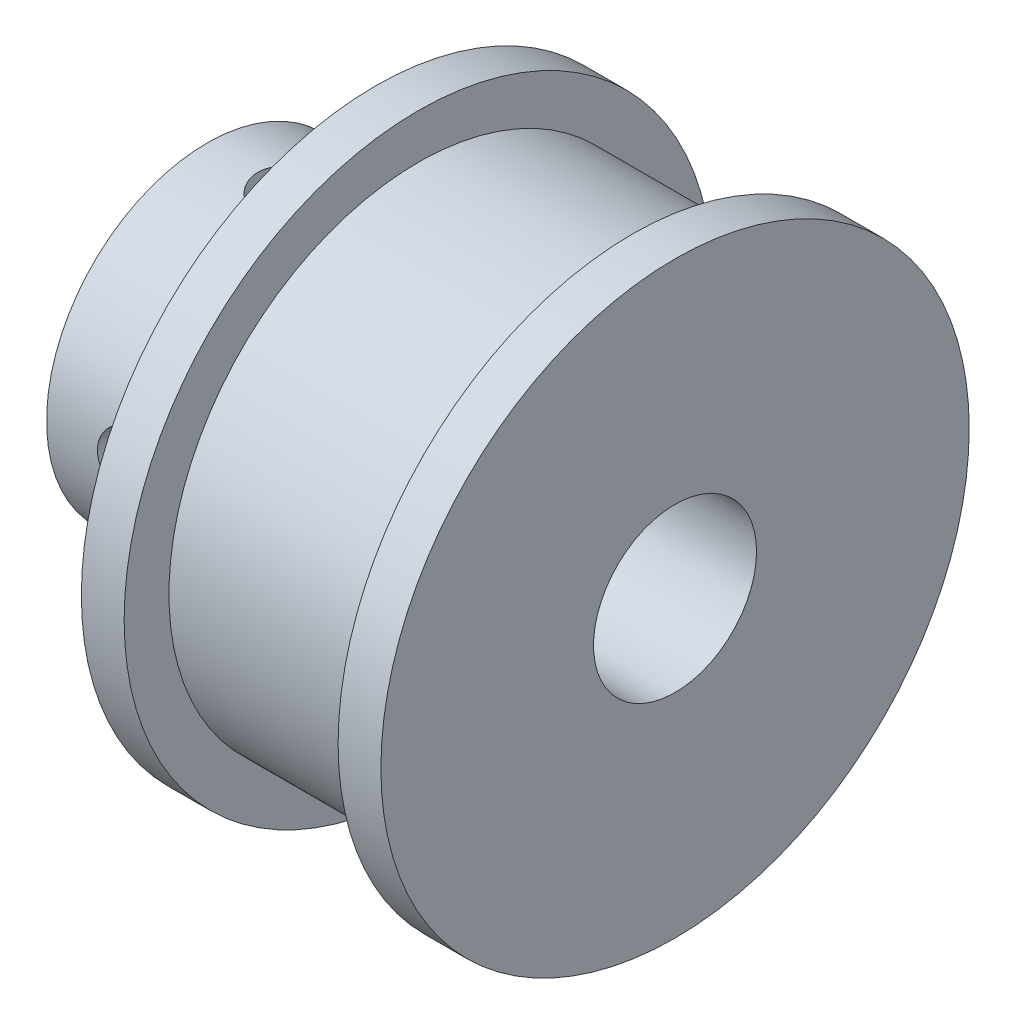
ISO-10303-21;
HEADER;
FILE_DESCRIPTION(('STEP AP214'),'2;1');
FILE_NAME('part.step','',(''),(''),'','','');
FILE_SCHEMA(('AUTOMOTIVE_DESIGN { 1 0 10303 214 1 1 1 1 }'));
ENDSEC;
DATA;
#1=APPLICATION_CONTEXT('core data for automotive mechanical design processes');
#2=APPLICATION_PROTOCOL_DEFINITION('international standard','automotive_design',2000,#1);
#3=PRODUCT_CONTEXT('',#1,'mechanical');
#4=PRODUCT('Part','Part','',(#3));
#5=PRODUCT_RELATED_PRODUCT_CATEGORY('part','',(#4));
#6=PRODUCT_DEFINITION_FORMATION('','',#4);
#7=PRODUCT_DEFINITION_CONTEXT('part definition',#1,'design');
#8=PRODUCT_DEFINITION('design','',#6,#7);
#9=PRODUCT_DEFINITION_SHAPE('','',#8);
#10=(LENGTH_UNIT() NAMED_UNIT(*) SI_UNIT(.MILLI.,.METRE.));
#11=(NAMED_UNIT(*) PLANE_ANGLE_UNIT() SI_UNIT($,.RADIAN.));
#12=(NAMED_UNIT(*) SI_UNIT($,.STERADIAN.) SOLID_ANGLE_UNIT());
#13=UNCERTAINTY_MEASURE_WITH_UNIT(LENGTH_MEASURE(1.E-05),#10,'distance_accuracy_value','');
#14=(GEOMETRIC_REPRESENTATION_CONTEXT(3) GLOBAL_UNCERTAINTY_ASSIGNED_CONTEXT((#13)) GLOBAL_UNIT_ASSIGNED_CONTEXT((#10,
#11,#12)) REPRESENTATION_CONTEXT('',''));
#15=CARTESIAN_POINT('',(0.,0.,0.));
#16=DIRECTION('',(0.,0.,1.));
#17=DIRECTION('',(1.,0.,0.));
#18=AXIS2_PLACEMENT_3D('',#15,#16,#17);
#19=CARTESIAN_POINT('',(0.,2.5,0.));
#20=DIRECTION('',(-1.,0.,0.));
#21=DIRECTION('',(0.,0.,1.));
#22=AXIS2_PLACEMENT_3D('',#19,#20,#21);
#23=PLANE('',#22);
#24=CARTESIAN_POINT('',(0.,0.,0.));
#25=DIRECTION('',(1.,0.,0.));
#26=DIRECTION('',(0.,0.,-1.));
#27=AXIS2_PLACEMENT_3D('',#24,#25,#26);
#28=CIRCLE('',#27,3.048);
#29=CARTESIAN_POINT('',(0.,0.,-3.048));
#30=VERTEX_POINT('',#29);
#31=EDGE_CURVE('E3311',#30,#30,#28,.T.);
#32=ORIENTED_EDGE('',*,*,#31,.T.);
#33=EDGE_LOOP('',(#32));
#34=FACE_BOUND('',#33,.T.);
#35=CARTESIAN_POINT('',(0.,0.,0.));
#36=DIRECTION('',(1.,0.,0.));
#37=DIRECTION('',(0.,0.,-1.));
#38=AXIS2_PLACEMENT_3D('',#35,#36,#37);
#39=CIRCLE('',#38,6.);
#40=CARTESIAN_POINT('',(0.,0.,-6.));
#41=VERTEX_POINT('',#40);
#42=EDGE_CURVE('E14',#41,#41,#39,.T.);
#43=ORIENTED_EDGE('',*,*,#42,.F.);
#44=EDGE_LOOP('',(#43));
#45=FACE_BOUND('',#44,.T.);
#46=ADVANCED_FACE('F3238',(#34,#45),#23,.T.);
#47=CARTESIAN_POINT('',(0.,0.,0.));
#48=DIRECTION('',(1.,0.,0.));
#49=DIRECTION('',(0.,0.,-1.));
#50=AXIS2_PLACEMENT_3D('',#47,#48,#49);
#51=CYLINDRICAL_SURFACE('',#50,6.);
#52=CARTESIAN_POINT('',(1.90000000000001,0.,6.));
#53=CARTESIAN_POINT('',(1.90000247746923,-0.0694090417016603,5.99999871526651));
#54=CARTESIAN_POINT('',(1.90580066571876,-0.138848789520875,5.99878328775043));
#55=CARTESIAN_POINT('',(1.92881934953286,-0.275761316266992,5.99405200990679));
#56=CARTESIAN_POINT('',(1.94604852303694,-0.343232560128311,5.99053441189248));
#57=CARTESIAN_POINT('',(1.99137045492183,-0.474209132291339,5.98159109196202));
#58=CARTESIAN_POINT('',(2.01945239599889,-0.537718336709182,5.97616727052645));
#59=CARTESIAN_POINT('',(2.08564960885619,-0.659120328605954,5.96399927809859));
#60=CARTESIAN_POINT('',(2.12376443115584,-0.717013367534323,5.95725516625975));
#61=CARTESIAN_POINT('',(2.20953634019065,-0.826390324308832,5.9430770002465));
#62=CARTESIAN_POINT('',(2.25731200123509,-0.87778024416268,5.93563505848531));
#63=CARTESIAN_POINT('',(2.36079465919511,-0.971877776769387,5.92095657692448));
#64=CARTESIAN_POINT('',(2.41650231187227,-1.01458467096098,5.91372005416683));
#65=CARTESIAN_POINT('',(2.53495196876616,-1.09051031677216,5.90019442595308));
#66=CARTESIAN_POINT('',(2.59775838450275,-1.1236305468065,5.89391545174828));
#67=CARTESIAN_POINT('',(2.72819745177276,-1.17881119348063,5.8831284065002));
#68=CARTESIAN_POINT('',(2.79582958244254,-1.20087280167641,5.87862014467568));
#69=CARTESIAN_POINT('',(2.93298523741564,-1.23300240133736,5.87196500986123));
#70=CARTESIAN_POINT('',(3.00246835933477,-1.24323597696798,5.86978556855865));
#71=CARTESIAN_POINT('',(3.14219684286263,-1.25193357655614,5.86793690716491));
#72=CARTESIAN_POINT('',(3.2124421188653,-1.25039890894686,5.86826740800981));
#73=CARTESIAN_POINT('',(3.35048102797518,-1.23573719037196,5.87137174319175));
#74=CARTESIAN_POINT('',(3.41829597966121,-1.2228010523272,5.87410533679901));
#75=CARTESIAN_POINT('',(3.55077150964493,-1.18600543529945,5.88164437615942));
#76=CARTESIAN_POINT('',(3.61543192560633,-1.16214539481381,5.88644992841317));
#77=CARTESIAN_POINT('',(3.74030722841598,-1.10400003213928,5.89763191464102));
#78=CARTESIAN_POINT('',(3.80048629652707,-1.06964002534236,5.90401953785586));
#79=CARTESIAN_POINT('',(3.91429574426816,-0.991522699274812,5.91763890010721));
#80=CARTESIAN_POINT('',(3.96792530883597,-0.947764212262582,5.92487074398537));
#81=CARTESIAN_POINT('',(4.06821396108037,-0.851074921546777,5.93953730929909));
#82=CARTESIAN_POINT('',(4.11471616889701,-0.797981433412077,5.94697323199473));
#83=CARTESIAN_POINT('',(4.19818044222897,-0.684667288611794,5.96108088143001));
#84=CARTESIAN_POINT('',(4.23514236459839,-0.624446525025762,5.96775259670236));
#85=CARTESIAN_POINT('',(4.29851008153595,-0.498405541235475,5.97959870942815));
#86=CARTESIAN_POINT('',(4.32489680456711,-0.432575461926497,5.98477039710258));
#87=CARTESIAN_POINT('',(4.36619170483549,-0.297284620972153,5.99301338211281));
#88=CARTESIAN_POINT('',(4.38110139323139,-0.227824338595088,5.99608495596053));
#89=CARTESIAN_POINT('',(4.39879425206788,-0.0885918657008349,5.99974275215455));
#90=CARTESIAN_POINT('',(4.40179194149424,-0.0188480555261788,6.00037293537579));
#91=CARTESIAN_POINT('',(4.39615505003089,0.120143798757714,5.99919952252774));
#92=CARTESIAN_POINT('',(4.3875211813984,0.189391872962257,5.99739607548153));
#93=CARTESIAN_POINT('',(4.35904434653046,0.324726367119811,5.99158564979184));
#94=CARTESIAN_POINT('',(4.33931251461653,0.390837192894204,5.98760052868077));
#95=CARTESIAN_POINT('',(4.28932213957859,0.518811446661328,5.97787227242395));
#96=CARTESIAN_POINT('',(4.25906275913401,0.580674536336772,5.97212899744579));
#97=CARTESIAN_POINT('',(4.18841962176244,0.69929430694349,5.95941241490714));
#98=CARTESIAN_POINT('',(4.14790807043093,0.755973219469829,5.9524239381233));
#99=CARTESIAN_POINT('',(4.05808043692373,0.861805445886515,5.93802568299709));
#100=CARTESIAN_POINT('',(4.00876332448106,0.910957877913281,5.93061585542511));
#101=CARTESIAN_POINT('',(3.9017444230003,1.0011786486518,5.91606024531377));
#102=CARTESIAN_POINT('',(3.84391696804472,1.04209914600204,5.90892089307501));
#103=CARTESIAN_POINT('',(3.72208371578621,1.11364719079243,5.89585601015805));
#104=CARTESIAN_POINT('',(3.65807817586089,1.14427516677863,5.88993042894651));
#105=CARTESIAN_POINT('',(3.52603880370177,1.19417246443921,5.88001700708041));
#106=CARTESIAN_POINT('',(3.45802896283416,1.21350309828031,5.87601872784687));
#107=CARTESIAN_POINT('',(3.31963344950774,1.24044038523407,5.87039184709697));
#108=CARTESIAN_POINT('',(3.24924811838056,1.2480487154444,5.86876290660367));
#109=CARTESIAN_POINT('',(3.10958659900035,1.25125926487611,5.86807907308506));
#110=CARTESIAN_POINT('',(3.04031592977795,1.24709542622725,5.86897402321502));
#111=CARTESIAN_POINT('',(2.90348599107978,1.22739905314031,5.87312447254928));
#112=CARTESIAN_POINT('',(2.8359267051839,1.21186662782265,5.87637994909626));
#113=CARTESIAN_POINT('',(2.70460222810934,1.16998217768584,5.88486132447716));
#114=CARTESIAN_POINT('',(2.64082675351308,1.14366117568421,5.8900815700793));
#115=CARTESIAN_POINT('',(2.51856122397334,1.08097457299757,5.90190705738738));
#116=CARTESIAN_POINT('',(2.46007166036688,1.04460803983029,5.9085124276546));
#117=CARTESIAN_POINT('',(2.34887837292056,0.962073695342405,5.92251579551146));
#118=CARTESIAN_POINT('',(2.29630087543502,0.91573789041822,5.92992613868404));
#119=CARTESIAN_POINT('',(2.19959050677365,0.814924438115329,5.94461839583213));
#120=CARTESIAN_POINT('',(2.15545958244852,0.760444918832963,5.9519002798488));
#121=CARTESIAN_POINT('',(2.07641142681595,0.644134427507699,5.96561444547637));
#122=CARTESIAN_POINT('',(2.04160632011372,0.582225921521345,5.97203596073244));
#123=CARTESIAN_POINT('',(1.98294977156998,0.453319843998451,5.98319908494092));
#124=CARTESIAN_POINT('',(1.95908875281813,0.386326781907242,5.98794216182101));
#125=CARTESIAN_POINT('',(1.92745972171158,0.266015292900104,5.99432499781443));
#126=CARTESIAN_POINT('',(1.91718123679115,0.213367593727928,5.99644035661395));
#127=CARTESIAN_POINT('',(1.90345054572268,0.107152674176536,5.99927832789758));
#128=CARTESIAN_POINT('',(1.89999808733282,0.0535854878488715,6.00000099184586));
#129=CARTESIAN_POINT('',(1.90000000000001,0.,6.));
#130=B_SPLINE_CURVE_WITH_KNOTS('',3,(#52,#53,#54,#55,#56,#57,#58,#59,#60,#61,#62,#63,#64,#65,
#66,#67,#68,#69,#70,#71,#72,#73,#74,#75,#76,#77,#78,#79,#80,#81,#82,#83,#84,#85,#86,#87,#88,#89,
#90,#91,#92,#93,#94,#95,#96,#97,#98,#99,#100,#101,#102,#103,#104,#105,#106,#107,#108,#109,#110,
#111,#112,#113,#114,#115,#116,#117,#118,#119,#120,#121,#122,#123,#124,#125,#126,#127,#128,#129),
.UNSPECIFIED.,.T.,.F.,(4,2,2,2,2,2,2,2,2,2,2,2,2,2,2,2,2,2,2,2,2,2,2,2,2,2,2,2,2,2,2,2,2,2,2,2,
2,2,4),(0.,0.208031045103182,0.416220199906223,0.624202378825439,0.832175241572985,
1.04287526388122,1.25359271551785,1.46640449178548,1.67919333285489,1.88896575169853,
2.09871484767163,2.30501712129058,2.51133000030278,2.71914592416748,2.92698768368033,
3.13889526355464,3.35080602278216,3.5630972449966,3.77536051045769,3.98378339407673,
4.19219351552275,4.39855286632619,4.60492863390931,4.81401583995734,5.02312752564571,
5.23571263829333,5.44828889851306,5.65970050095022,5.87108185414182,6.07829223291035,
6.28550062281358,6.49211731393252,6.69875319081476,6.90919024830305,7.11967575117366,
7.33258864398252,7.54531486464969,7.70592588477276,7.86653096973387),.UNSPECIFIED.);
#131=CARTESIAN_POINT('',(1.90000000000001,0.,6.));
#132=VERTEX_POINT('',#131);
#133=EDGE_CURVE('E3264',#132,#132,#130,.T.);
#134=ORIENTED_EDGE('',*,*,#133,.F.);
#135=EDGE_LOOP('',(#134));
#136=FACE_BOUND('',#135,.T.);
#137=CARTESIAN_POINT('',(3.15,5.86834729715275,-1.25));
#138=CARTESIAN_POINT('',(3.08060938484897,5.86834869213645,-1.24999750877599));
#139=CARTESIAN_POINT('',(3.01118802798478,5.86959145924544,-1.24420229433948));
#140=CARTESIAN_POINT('',(2.87431368268275,5.87442015581798,-1.22119649233779));
#141=CARTESIAN_POINT('',(2.80686224449358,5.87800788138388,-1.20397715440342));
#142=CARTESIAN_POINT('',(2.67592762716513,5.8871029296193,-1.1586839750723));
#143=CARTESIAN_POINT('',(2.6124404040082,5.89260825706945,-1.13062141248932));
#144=CARTESIAN_POINT('',(2.4910755003544,5.90491581335741,-1.06446988601732));
#145=CARTESIAN_POINT('',(2.43319759326998,5.91171798977622,-1.0263813273582));
#146=CARTESIAN_POINT('',(2.32380462484654,5.92596934661468,-0.940636399466082));
#147=CARTESIAN_POINT('',(2.27238810637353,5.93342614373039,-0.892855554869668));
#148=CARTESIAN_POINT('',(2.1782389313519,5.94807966802575,-0.789351223880636));
#149=CARTESIAN_POINT('',(2.13550691170856,5.95527637609915,-0.733627155456002));
#150=CARTESIAN_POINT('',(2.05955411191714,5.96868135118848,-0.615162052999588));
#151=CARTESIAN_POINT('',(2.02642747353674,5.97487958631242,-0.552359428204941));
#152=CARTESIAN_POINT('',(1.97123394714022,5.98550347343302,-0.421928551006719));
#153=CARTESIAN_POINT('',(1.94916593484647,5.98992930561222,-0.354300789950591));
#154=CARTESIAN_POINT('',(1.91702423888253,5.99645589892179,-0.217162904200502));
#155=CARTESIAN_POINT('',(1.90678398280484,5.99858891959926,-0.147693380916357));
#156=CARTESIAN_POINT('',(1.89806830424298,6.00040112580612,-0.00799184883952432));
#157=CARTESIAN_POINT('',(1.8995916558069,6.0000805670369,0.0622400797368385));
#158=CARTESIAN_POINT('',(1.91423460095674,5.99704658090511,0.200326586199572));
#159=CARTESIAN_POINT('',(1.92717471895812,5.99437018956584,0.268201128726475));
#160=CARTESIAN_POINT('',(1.96399862533131,5.98696720898885,0.400793746289752));
#161=CARTESIAN_POINT('',(1.98788287720308,5.98224053291904,0.465511687511022));
#162=CARTESIAN_POINT('',(2.0460800521255,5.97120767323924,0.590460005384683));
#163=CARTESIAN_POINT('',(2.08046229420966,5.96489104125346,0.65065713498165));
#164=CARTESIAN_POINT('',(2.15862800284042,5.95137300440189,0.764493456510647));
#165=CARTESIAN_POINT('',(2.20241263820613,5.94417148958325,0.818131831816418));
#166=CARTESIAN_POINT('',(2.29912162489106,5.92951700233276,0.918394203276912));
#167=CARTESIAN_POINT('',(2.35220305998195,5.92206184975925,0.964866487494794));
#168=CARTESIAN_POINT('',(2.4654820489948,5.90786872648996,1.04827597240488));
#169=CARTESIAN_POINT('',(2.52567976138724,5.9011307717716,1.0852129606998));
#170=CARTESIAN_POINT('',(2.6517122548288,5.88912998409156,1.14856217138454));
#171=CARTESIAN_POINT('',(2.71756065069343,5.88387085232125,1.17494805489727));
#172=CARTESIAN_POINT('',(2.85289161936939,5.8754760641036,1.21623577538673));
#173=CARTESIAN_POINT('',(2.92237367280809,5.87234010507182,1.23113924882349));
#174=CARTESIAN_POINT('',(3.06161970631891,5.86860783239132,1.24880863867017));
#175=CARTESIAN_POINT('',(3.13135458453703,5.86796551863474,1.25179442917998));
#176=CARTESIAN_POINT('',(3.27032581154014,5.86916952018704,1.24613693439294));
#177=CARTESIAN_POINT('',(3.33956219090234,5.87101568152623,1.23749436857863));
#178=CARTESIAN_POINT('',(3.47482051605812,5.87694538226166,1.20901558325484));
#179=CARTESIAN_POINT('',(3.54086866717883,5.88100511282998,1.18929841376871));
#180=CARTESIAN_POINT('',(3.6687239894416,5.8908833850312,1.13935810860919));
#181=CARTESIAN_POINT('',(3.7305307856504,5.89670208191057,1.10913404556146));
#182=CARTESIAN_POINT('',(3.84910644121623,5.90954501937191,1.03854598181485));
#183=CARTESIAN_POINT('',(3.90579220446617,5.91658506648323,0.998045327353962));
#184=CARTESIAN_POINT('',(4.01164324915506,5.93103483993908,0.908234440569878));
#185=CARTESIAN_POINT('',(4.06080768623923,5.93844460766532,0.858923220505172));
#186=CARTESIAN_POINT('',(4.15106271309716,5.95294924316736,0.751900450843339));
#187=CARTESIAN_POINT('',(4.19200409502638,5.9600367471991,0.694061907614551));
#188=CARTESIAN_POINT('',(4.26358875208798,5.97296708772407,0.57220010221636));
#189=CARTESIAN_POINT('',(4.29423248223745,5.97880997920818,0.508177113476881));
#190=CARTESIAN_POINT('',(4.34413867931735,5.98856148270679,0.376142117847919));
#191=CARTESIAN_POINT('',(4.36346916554434,5.99248163136497,0.308156710970195));
#192=CARTESIAN_POINT('',(4.3904144040081,5.99799561410226,0.169813400503473));
#193=CARTESIAN_POINT('',(4.39803069353274,5.99958975342889,0.0994558094616958));
#194=CARTESIAN_POINT('',(4.40126762204851,6.00026408056941,-0.0402133434703387));
#195=CARTESIAN_POINT('',(4.39711189999473,5.99939113754811,-0.109519592177922));
#196=CARTESIAN_POINT('',(4.37741936134707,5.99532874094472,-0.246422870373552));
#197=CARTESIAN_POINT('',(4.36188271359323,5.99213932172839,-0.314019925202702));
#198=CARTESIAN_POINT('',(4.31997220535144,5.98380460077544,-0.445431965492052));
#199=CARTESIAN_POINT('',(4.29362733614689,5.97866453407556,-0.509256550004524));
#200=CARTESIAN_POINT('',(4.230877602268,5.96697995347704,-0.631610567220741));
#201=CARTESIAN_POINT('',(4.19447186165686,5.96043531730246,-0.690139538279511));
#202=CARTESIAN_POINT('',(4.11189033200669,5.94651596786386,-0.80134032129826));
#203=CARTESIAN_POINT('',(4.0655557119433,5.93912880302851,-0.853892633615926));
#204=CARTESIAN_POINT('',(3.96475549900292,5.9244278681135,-0.950552741980385));
#205=CARTESIAN_POINT('',(3.91028797005157,5.91711411595368,-0.994658521571232));
#206=CARTESIAN_POINT('',(3.79399089756656,5.90329191643327,-1.07367451852767));
#207=CARTESIAN_POINT('',(3.73208158853791,5.89679406702551,-1.10846928126994));
#208=CARTESIAN_POINT('',(3.60317484391674,5.88547039658063,-1.16710627925306));
#209=CARTESIAN_POINT('',(3.53618195154699,5.88064310352601,-1.1909581629246));
#210=CARTESIAN_POINT('',(3.41589371843157,5.87414004405196,-1.22256554131861));
#211=CARTESIAN_POINT('',(3.36327046340695,5.87198163591589,-1.2328344900567));
#212=CARTESIAN_POINT('',(3.25710421947899,5.86908475266778,-1.24655254358404));
#213=CARTESIAN_POINT('',(3.20356126768996,5.86834622039193,-1.25000192292741));
#214=CARTESIAN_POINT('',(3.15,5.86834729715275,-1.25));
#215=B_SPLINE_CURVE_WITH_KNOTS('',3,(#137,#138,#139,#140,#141,#142,#143,#144,#145,#146,#147,
#148,#149,#150,#151,#152,#153,#154,#155,#156,#157,#158,#159,#160,#161,#162,#163,#164,#165,#166,
#167,#168,#169,#170,#171,#172,#173,#174,#175,#176,#177,#178,#179,#180,#181,#182,#183,#184,#185,
#186,#187,#188,#189,#190,#191,#192,#193,#194,#195,#196,#197,#198,#199,#200,#201,#202,#203,#204,
#205,#206,#207,#208,#209,#210,#211,#212,#213,#214),.UNSPECIFIED.,.T.,.F.,(4,2,2,2,2,2,2,2,2,2,2,
2,2,2,2,2,2,2,2,2,2,2,2,2,2,2,2,2,2,2,2,2,2,2,2,2,2,2,4),(0.,0.207975654071269,0.41611079241747,
0.624030014802729,0.831940834815791,1.04271333467885,1.25350128663874,1.46629026266844,
1.67905760106933,1.88879048859264,2.09850151896339,2.30497341416461,2.5114540545587,
2.71932871977949,2.9272292410426,3.13905862244913,3.35089272191628,3.56325237332487,
3.77558175387597,3.98397516009792,4.19235567296524,4.39853786231922,4.60473825464031,
4.81383917934651,5.02296356082185,5.23559458753343,5.4482162175904,5.65954599648534,
5.87084803959581,6.07816293922644,6.28547476332981,6.492234105851,6.69901145528173,
6.90938318978573,7.11980508427535,7.33272651358123,7.54545984571988,7.70599867585769,
7.8665310426116),.UNSPECIFIED.);
#216=CARTESIAN_POINT('',(3.15,5.86834729715275,-1.25));
#217=VERTEX_POINT('',#216);
#218=EDGE_CURVE('E3258',#217,#217,#215,.T.);
#219=ORIENTED_EDGE('',*,*,#218,.F.);
#220=EDGE_LOOP('',(#219));
#221=FACE_BOUND('',#220,.T.);
#222=ORIENTED_EDGE('',*,*,#42,.T.);
#223=EDGE_LOOP('',(#222));
#224=FACE_BOUND('',#223,.T.);
#225=CARTESIAN_POINT('',(6.3,0.,0.));
#226=DIRECTION('',(1.,0.,0.));
#227=DIRECTION('',(0.,0.,-1.));
#228=AXIS2_PLACEMENT_3D('',#225,#226,#227);
#229=CIRCLE('',#228,6.);
#230=CARTESIAN_POINT('',(6.3,0.,-6.));
#231=VERTEX_POINT('',#230);
#232=EDGE_CURVE('E3249',#231,#231,#229,.T.);
#233=ORIENTED_EDGE('',*,*,#232,.F.);
#234=EDGE_LOOP('',(#233));
#235=FACE_BOUND('',#234,.T.);
#236=ADVANCED_FACE('F3267',(#136,#221,#224,#235),#51,.T.);
#237=CARTESIAN_POINT('',(6.3,11.,0.));
#238=DIRECTION('',(-1.,0.,0.));
#239=DIRECTION('',(0.,0.,1.));
#240=AXIS2_PLACEMENT_3D('',#237,#238,#239);
#241=PLANE('',#240);
#242=ORIENTED_EDGE('',*,*,#232,.T.);
#243=EDGE_LOOP('',(#242));
#244=FACE_BOUND('',#243,.T.);
#245=CARTESIAN_POINT('',(6.3,0.,0.));
#246=DIRECTION('',(1.,0.,0.));
#247=DIRECTION('',(0.,0.,-1.));
#248=AXIS2_PLACEMENT_3D('',#245,#246,#247);
#249=CIRCLE('',#248,11.);
#250=CARTESIAN_POINT('',(6.3,0.,-11.));
#251=VERTEX_POINT('',#250);
#252=EDGE_CURVE('E3254',#251,#251,#249,.T.);
#253=ORIENTED_EDGE('',*,*,#252,.F.);
#254=EDGE_LOOP('',(#253));
#255=FACE_BOUND('',#254,.T.);
#256=ADVANCED_FACE('F3306',(#244,#255),#241,.T.);
#257=CARTESIAN_POINT('',(0.,0.,0.));
#258=DIRECTION('',(1.,0.,0.));
#259=DIRECTION('',(0.,0.,-1.));
#260=AXIS2_PLACEMENT_3D('',#257,#258,#259);
#261=CYLINDRICAL_SURFACE('',#260,11.);
#262=ORIENTED_EDGE('',*,*,#252,.T.);
#263=EDGE_LOOP('',(#262));
#264=FACE_BOUND('',#263,.T.);
#265=CARTESIAN_POINT('',(7.9,0.,0.));
#266=DIRECTION('',(1.,0.,0.));
#267=DIRECTION('',(0.,0.,-1.));
#268=AXIS2_PLACEMENT_3D('',#265,#266,#267);
#269=CIRCLE('',#268,11.);
#270=CARTESIAN_POINT('',(7.9,0.,-11.));
#271=VERTEX_POINT('',#270);
#272=EDGE_CURVE('E3335',#271,#271,#269,.T.);
#273=ORIENTED_EDGE('',*,*,#272,.F.);
#274=EDGE_LOOP('',(#273));
#275=FACE_BOUND('',#274,.T.);
#276=ADVANCED_FACE('F3340',(#264,#275),#261,.T.);
#277=CARTESIAN_POINT('',(7.9,11.,0.));
#278=DIRECTION('',(1.,0.,0.));
#279=DIRECTION('',(0.,0.,-1.));
#280=AXIS2_PLACEMENT_3D('',#277,#278,#279);
#281=PLANE('',#280);
#282=ORIENTED_EDGE('',*,*,#272,.T.);
#283=EDGE_LOOP('',(#282));
#284=FACE_BOUND('',#283,.T.);
#285=CARTESIAN_POINT('',(7.9,0.,0.));
#286=DIRECTION('',(1.,0.,0.));
#287=DIRECTION('',(0.,0.,-1.));
#288=AXIS2_PLACEMENT_3D('',#285,#286,#287);
#289=CIRCLE('',#288,9.325);
#290=CARTESIAN_POINT('',(7.9,0.,-9.325));
#291=VERTEX_POINT('',#290);
#292=EDGE_CURVE('E3330',#291,#291,#289,.T.);
#293=ORIENTED_EDGE('',*,*,#292,.F.);
#294=EDGE_LOOP('',(#293));
#295=FACE_BOUND('',#294,.T.);
#296=ADVANCED_FACE('F3348',(#284,#295),#281,.T.);
#297=CARTESIAN_POINT('',(0.,0.,0.));
#298=DIRECTION('',(1.,0.,0.));
#299=DIRECTION('',(0.,0.,-1.));
#300=AXIS2_PLACEMENT_3D('',#297,#298,#299);
#301=CYLINDRICAL_SURFACE('',#300,9.325);
#302=ORIENTED_EDGE('',*,*,#292,.T.);
#303=EDGE_LOOP('',(#302));
#304=FACE_BOUND('',#303,.T.);
#305=CARTESIAN_POINT('',(15.9,0.,0.));
#306=DIRECTION('',(1.,0.,0.));
#307=DIRECTION('',(0.,0.,-1.));
#308=AXIS2_PLACEMENT_3D('',#305,#306,#307);
#309=CIRCLE('',#308,9.325);
#310=CARTESIAN_POINT('',(15.9,0.,-9.325));
#311=VERTEX_POINT('',#310);
#312=EDGE_CURVE('E3326',#311,#311,#309,.T.);
#313=ORIENTED_EDGE('',*,*,#312,.F.);
#314=EDGE_LOOP('',(#313));
#315=FACE_BOUND('',#314,.T.);
#316=ADVANCED_FACE('F3353',(#304,#315),#301,.T.);
#317=CARTESIAN_POINT('',(15.9,9.325,0.));
#318=DIRECTION('',(-1.,0.,0.));
#319=DIRECTION('',(0.,0.,1.));
#320=AXIS2_PLACEMENT_3D('',#317,#318,#319);
#321=PLANE('',#320);
#322=ORIENTED_EDGE('',*,*,#312,.T.);
#323=EDGE_LOOP('',(#322));
#324=FACE_BOUND('',#323,.T.);
#325=CARTESIAN_POINT('',(15.9,0.,0.));
#326=DIRECTION('',(1.,0.,0.));
#327=DIRECTION('',(0.,0.,-1.));
#328=AXIS2_PLACEMENT_3D('',#325,#326,#327);
#329=CIRCLE('',#328,11.);
#330=CARTESIAN_POINT('',(15.9,0.,-11.));
#331=VERTEX_POINT('',#330);
#332=EDGE_CURVE('E3324',#331,#331,#329,.T.);
#333=ORIENTED_EDGE('',*,*,#332,.F.);
#334=EDGE_LOOP('',(#333));
#335=FACE_BOUND('',#334,.T.);
#336=ADVANCED_FACE('F3357',(#324,#335),#321,.T.);
#337=CARTESIAN_POINT('',(0.,0.,0.));
#338=DIRECTION('',(1.,0.,0.));
#339=DIRECTION('',(0.,0.,-1.));
#340=AXIS2_PLACEMENT_3D('',#337,#338,#339);
#341=CYLINDRICAL_SURFACE('',#340,11.);
#342=ORIENTED_EDGE('',*,*,#332,.T.);
#343=EDGE_LOOP('',(#342));
#344=FACE_BOUND('',#343,.T.);
#345=CARTESIAN_POINT('',(17.5,0.,0.));
#346=DIRECTION('',(1.,0.,0.));
#347=DIRECTION('',(0.,0.,-1.));
#348=AXIS2_PLACEMENT_3D('',#345,#346,#347);
#349=CIRCLE('',#348,11.);
#350=CARTESIAN_POINT('',(17.5,0.,-11.));
#351=VERTEX_POINT('',#350);
#352=EDGE_CURVE('E3263',#351,#351,#349,.T.);
#353=ORIENTED_EDGE('',*,*,#352,.F.);
#354=EDGE_LOOP('',(#353));
#355=FACE_BOUND('',#354,.T.);
#356=ADVANCED_FACE('F3320',(#344,#355),#341,.T.);
#357=CARTESIAN_POINT('',(17.5,11.,0.));
#358=DIRECTION('',(1.,0.,0.));
#359=DIRECTION('',(0.,0.,-1.));
#360=AXIS2_PLACEMENT_3D('',#357,#358,#359);
#361=PLANE('',#360);
#362=CARTESIAN_POINT('',(17.5,0.,0.));
#363=DIRECTION('',(1.,0.,0.));
#364=DIRECTION('',(0.,0.,-1.));
#365=AXIS2_PLACEMENT_3D('',#362,#363,#364);
#366=CIRCLE('',#365,3.048);
#367=CARTESIAN_POINT('',(17.5,0.,-3.048));
#368=VERTEX_POINT('',#367);
#369=EDGE_CURVE('E3287',#368,#368,#366,.T.);
#370=ORIENTED_EDGE('',*,*,#369,.F.);
#371=EDGE_LOOP('',(#370));
#372=FACE_BOUND('',#371,.T.);
#373=ORIENTED_EDGE('',*,*,#352,.T.);
#374=EDGE_LOOP('',(#373));
#375=FACE_BOUND('',#374,.T.);
#376=ADVANCED_FACE('F3275',(#372,#375),#361,.T.);
#377=CARTESIAN_POINT('',(3.15,0.,0.));
#378=DIRECTION('',(0.,-1.,0.));
#379=DIRECTION('',(0.,0.,-1.));
#380=AXIS2_PLACEMENT_3D('',#377,#378,#379);
#381=CYLINDRICAL_SURFACE('',#380,1.25);
#382=CARTESIAN_POINT('',(3.15,2.77989280368866,-1.25));
#383=CARTESIAN_POINT('',(3.21677845101732,2.77989947234388,-1.24999301812315));
#384=CARTESIAN_POINT('',(3.28367021653166,2.78233398447989,-1.24461491156926));
#385=CARTESIAN_POINT('',(3.41552969764054,2.79176472386089,-1.2233071980871));
#386=CARTESIAN_POINT('',(3.48049159798157,2.79877351361406,-1.20734853145494));
#387=CARTESIAN_POINT('',(3.6063486726186,2.8164142452245,-1.16559952389135));
#388=CARTESIAN_POINT('',(3.66725894779367,2.82703171359217,-1.13984840968373));
#389=CARTESIAN_POINT('',(3.78387640422449,2.85067280565713,-1.07936032302412));
#390=CARTESIAN_POINT('',(3.83958492469685,2.8636958074526,-1.04462567215641));
#391=CARTESIAN_POINT('',(3.94760833438933,2.89155847056284,-0.964918763974865));
#392=CARTESIAN_POINT('',(3.99957170098567,2.90645850425694,-0.919490977962234));
#393=CARTESIAN_POINT('',(4.09540139813872,2.93589927525135,-0.820644526768571));
#394=CARTESIAN_POINT('',(4.13926466315097,2.95043987472523,-0.767222850029464));
#395=CARTESIAN_POINT('',(4.21942168307966,2.97825331125604,-0.651163060686284));
#396=CARTESIAN_POINT('',(4.25532252694916,2.99144777956926,-0.588233098267574));
#397=CARTESIAN_POINT('',(4.31587706754724,3.01434638957064,-0.456588612399966));
#398=CARTESIAN_POINT('',(4.3405356093158,3.02405203443774,-0.38787659596725));
#399=CARTESIAN_POINT('',(4.37663958479296,3.03845167214993,-0.250306543425851));
#400=CARTESIAN_POINT('',(4.3886904862685,3.04337441187714,-0.181631836158603));
#401=CARTESIAN_POINT('',(4.40119081924389,3.04848285151744,-0.0430703844903899));
#402=CARTESIAN_POINT('',(4.40164480175464,3.04867040967055,0.0268158736837226));
#403=CARTESIAN_POINT('',(4.39126151926993,3.04442383021979,0.161424435576712));
#404=CARTESIAN_POINT('',(4.38108876335528,3.04026168121607,0.226208164381422));
#405=CARTESIAN_POINT('',(4.35087636729472,3.02815412500318,0.353054818642942));
#406=CARTESIAN_POINT('',(4.33083600107164,3.02020843939574,0.415117543517179));
#407=CARTESIAN_POINT('',(4.2812154111596,3.00115333903139,0.53589207491836));
#408=CARTESIAN_POINT('',(4.25149480998101,2.98999767077941,0.594538607469158));
#409=CARTESIAN_POINT('',(4.18349247038621,2.96562040700957,0.706164784982445));
#410=CARTESIAN_POINT('',(4.14520773951527,2.95239808985665,0.759142439552291));
#411=CARTESIAN_POINT('',(4.05810775464852,2.92415009904433,0.861786297360111));
#412=CARTESIAN_POINT('',(4.00875037486694,2.90906293862212,0.9109762281099));
#413=CARTESIAN_POINT('',(3.90244300735029,2.87947401975794,1.0005822686455));
#414=CARTESIAN_POINT('',(3.84549028263844,2.86497247480775,1.04099520178323));
#415=CARTESIAN_POINT('',(3.72337229713537,2.83776593912979,1.11306892019921));
#416=CARTESIAN_POINT('',(3.65800722762143,2.82513054974514,1.14441966826116));
#417=CARTESIAN_POINT('',(3.52226934003177,2.80391047235909,1.19547630715644));
#418=CARTESIAN_POINT('',(3.45190000958398,2.79532299447083,1.21519022065754));
#419=CARTESIAN_POINT('',(3.31291584971633,2.78385696584113,1.24122334463254));
#420=CARTESIAN_POINT('',(3.2444727069249,2.78065094302003,1.2483126417368));
#421=CARTESIAN_POINT('',(3.10731450264987,2.77937584748705,1.25115091817584));
#422=CARTESIAN_POINT('',(3.03859953785813,2.78130508794549,1.2469036213502));
#423=CARTESIAN_POINT('',(2.90727300149744,2.7897456883617,1.22789144063377));
#424=CARTESIAN_POINT('',(2.84454519324781,2.7959695572722,1.21378577335331));
#425=CARTESIAN_POINT('',(2.72239422979539,2.81193502570289,1.1763234692374));
#426=CARTESIAN_POINT('',(2.66297183467185,2.82167743048253,1.15296471460252));
#427=CARTESIAN_POINT('',(2.54635362383938,2.84407768758503,1.09657660373644));
#428=CARTESIAN_POINT('',(2.48935377217533,2.8568401106169,1.06318483116668));
#429=CARTESIAN_POINT('',(2.38149812729191,2.88368950682335,0.988043022988487));
#430=CARTESIAN_POINT('',(2.3306449471135,2.89777703882763,0.946289452556065));
#431=CARTESIAN_POINT('',(2.23237968800093,2.92702222974606,0.851749123602495));
#432=CARTESIAN_POINT('',(2.18554978441367,2.94217721461619,0.798354074370834));
#433=CARTESIAN_POINT('',(2.10141588297457,2.97081891458262,0.684107653855349));
#434=CARTESIAN_POINT('',(2.06411245550298,2.98430552976343,0.62325583643389));
#435=CARTESIAN_POINT('',(2.00017200679215,3.00815973565856,0.495482754878371));
#436=CARTESIAN_POINT('',(1.97354989711114,3.01852296100868,0.428553164564997));
#437=CARTESIAN_POINT('',(1.93212948854373,3.03490476307916,0.290633044847303));
#438=CARTESIAN_POINT('',(1.91732439712738,3.04092583551632,0.219644873538101));
#439=CARTESIAN_POINT('',(1.90079418571846,3.0476660206603,0.0808356302163616));
#440=CARTESIAN_POINT('',(1.89824733931272,3.04871812784384,0.0131278830766495));
#441=CARTESIAN_POINT('',(1.90411232074377,3.04631454376449,-0.121722233482567));
#442=CARTESIAN_POINT('',(1.91252233178152,3.04285959983313,-0.188864694776515));
#443=CARTESIAN_POINT('',(1.93947302535515,3.03200190864393,-0.318361211738296));
#444=CARTESIAN_POINT('',(1.95766434304443,3.02473550474334,-0.380800343076048));
#445=CARTESIAN_POINT('',(2.00328580192742,3.00704451653161,-0.501722051328511));
#446=CARTESIAN_POINT('',(2.03071772571867,2.99661932290004,-0.560203862223856));
#447=CARTESIAN_POINT('',(2.09542208653935,2.97304419094788,-0.674437889803685));
#448=CARTESIAN_POINT('',(2.13308077388186,2.95979299815782,-0.729949956755665));
#449=CARTESIAN_POINT('',(2.21659987321252,2.93214739358634,-0.834100689491089));
#450=CARTESIAN_POINT('',(2.26246320977729,2.91775257517591,-0.88273689324487));
#451=CARTESIAN_POINT('',(2.36463917180441,2.88826095509362,-0.975066253335251));
#452=CARTESIAN_POINT('',(2.42143964303815,2.87317997958321,-1.01822651330364));
#453=CARTESIAN_POINT('',(2.54195864319079,2.8450120567513,-1.09447220076947));
#454=CARTESIAN_POINT('',(2.60568094734691,2.83192620703776,-1.12755209252725));
#455=CARTESIAN_POINT('',(2.7379426765626,2.80951611849229,-1.1822843651961));
#456=CARTESIAN_POINT('',(2.80644435136149,2.80016562180153,-1.20401685767501));
#457=CARTESIAN_POINT('',(2.94650524221309,2.78646841558585,-1.23539619497521));
#458=CARTESIAN_POINT('',(3.01805335875586,2.7821049247433,-1.24508358141688));
#459=CARTESIAN_POINT('',(3.10986755533728,2.78010812632471,-1.24951896962854));
#460=CARTESIAN_POINT('',(3.12992865925281,2.77989079931675,-1.25000209851572));
#461=CARTESIAN_POINT('',(3.15,2.77989280368866,-1.25));
#462=B_SPLINE_CURVE_WITH_KNOTS('',3,(#382,#383,#384,#385,#386,#387,#388,#389,#390,#391,#392,
#393,#394,#395,#396,#397,#398,#399,#400,#401,#402,#403,#404,#405,#406,#407,#408,#409,#410,#411,
#412,#413,#414,#415,#416,#417,#418,#419,#420,#421,#422,#423,#424,#425,#426,#427,#428,#429,#430,
#431,#432,#433,#434,#435,#436,#437,#438,#439,#440,#441,#442,#443,#444,#445,#446,#447,#448,#449,
#450,#451,#452,#453,#454,#455,#456,#457,#458,#459,#460,#461),.UNSPECIFIED.,.T.,.F.,(4,2,2,2,2,2,
2,2,2,2,2,2,2,2,2,2,2,2,2,2,2,2,2,2,2,2,2,2,2,2,2,2,2,2,2,2,2,2,2,4),(0.,0.200279325419666,
0.401111013124897,0.60114653941086,0.801130422771668,1.01203668283337,1.22302259910452,
1.44282520808766,1.66253300006354,1.8711231832879,2.07963150763337,2.27583958883217,
2.47206210954564,2.67126725173546,2.8705421086679,3.0834833818929,3.29650159673214,
3.51612117749679,3.73558917072998,3.94114080389337,4.14662492585297,4.3395402653515,
4.5324997838635,4.73349998177949,4.9345853295441,5.15143261307088,5.3682928768875,
5.58545484184638,5.80249189004953,6.00475576545929,6.20698610697915,6.40243134658165,
6.59791431097291,6.80216689096294,7.00649242311634,7.22420967875645,7.44204628152953,
7.6583234436792,7.8738706684826,7.93406785071541),.UNSPECIFIED.);
#463=CARTESIAN_POINT('',(3.15,2.77989280368866,-1.25));
#464=VERTEX_POINT('',#463);
#465=EDGE_CURVE('E3281',#464,#464,#462,.T.);
#466=ORIENTED_EDGE('',*,*,#465,.T.);
#467=EDGE_LOOP('',(#466));
#468=FACE_BOUND('',#467,.T.);
#469=ORIENTED_EDGE('',*,*,#218,.T.);
#470=EDGE_LOOP('',(#469));
#471=FACE_BOUND('',#470,.T.);
#472=ADVANCED_FACE('F3270',(#468,#471),#381,.F.);
#473=CARTESIAN_POINT('',(3.15,0.,0.));
#474=DIRECTION('',(0.,0.,-1.));
#475=DIRECTION('',(-1.,0.,0.));
#476=AXIS2_PLACEMENT_3D('',#473,#474,#475);
#477=CYLINDRICAL_SURFACE('',#476,1.24999999999999);
#478=CARTESIAN_POINT('',(1.90000000000001,0.,3.048));
#479=CARTESIAN_POINT('',(1.90000684269169,0.0670474127627889,3.04799488788855));
#480=CARTESIAN_POINT('',(1.90542651663839,0.134204741227559,3.04576194636763));
#481=CARTESIAN_POINT('',(1.92691477122667,0.26662013430918,3.03704624953909));
#482=CARTESIAN_POINT('',(1.94301161126536,0.331872677728507,3.03055221683814));
#483=CARTESIAN_POINT('',(1.98516373453626,0.458347465916441,3.0140129601076));
#484=CARTESIAN_POINT('',(2.01118572496339,0.519582391099747,3.0039796166635));
#485=CARTESIAN_POINT('',(2.07231420522083,0.63675987576655,2.98134314476263));
#486=CARTESIAN_POINT('',(2.10741778433261,0.692704123121934,2.96874083995152));
#487=CARTESIAN_POINT('',(2.18752969911059,0.800538324869749,2.94154248667009));
#488=CARTESIAN_POINT('',(2.23291074754826,0.852135123130315,2.92688248426973));
#489=CARTESIAN_POINT('',(2.33150194130106,0.947236069386631,2.897504120045));
#490=CARTESIAN_POINT('',(2.38471606602257,0.990736078415707,2.88278573227947));
#491=CARTESIAN_POINT('',(2.50051731702318,1.0704397349106,2.8541798774397));
#492=CARTESIAN_POINT('',(2.56342879901046,1.1062007630231,2.84036467715339));
#493=CARTESIAN_POINT('',(2.69502384251862,1.16650227660561,2.81613926853902));
#494=CARTESIAN_POINT('',(2.76370450227819,1.19104836339456,2.80572736117246));
#495=CARTESIAN_POINT('',(2.90151580634314,1.22702249307514,2.79017737378942));
#496=CARTESIAN_POINT('',(2.97047309376187,1.23901363129529,2.78481411804275));
#497=CARTESIAN_POINT('',(3.10961352845297,1.2512952074354,2.77931904738883));
#498=CARTESIAN_POINT('',(3.17979600996205,1.25159181354801,2.77918447465276));
#499=CARTESIAN_POINT('',(3.3138660952171,1.24090105917455,2.78397079715617));
#500=CARTESIAN_POINT('',(3.37783592707081,1.2307450865785,2.78851922132348));
#501=CARTESIAN_POINT('',(3.50306759061699,1.20082870497325,2.80153130676372));
#502=CARTESIAN_POINT('',(3.56432892017679,1.18106652313455,2.80999569071456));
#503=CARTESIAN_POINT('',(3.68392505614945,1.13211662580419,2.83007521580434));
#504=CARTESIAN_POINT('',(3.74217166457133,1.10274011971029,2.8417526500535));
#505=CARTESIAN_POINT('',(3.85313027064524,1.0355285489299,2.86692697827567));
#506=CARTESIAN_POINT('',(3.90584011375717,0.997690209251098,2.88042457590328));
#507=CARTESIAN_POINT('',(4.00875705512128,0.911001384670692,2.90905938779553));
#508=CARTESIAN_POINT('',(4.05840866238232,0.861504128969975,2.92424050522732));
#509=CARTESIAN_POINT('',(4.14888939054601,0.754730426284133,2.9535993923478));
#510=CARTESIAN_POINT('',(4.18971657103287,0.69745227284633,2.96777694090033));
#511=CARTESIAN_POINT('',(4.26216961413959,0.575099507894373,2.9939199246938));
#512=CARTESIAN_POINT('',(4.29357629926634,0.509882547661171,3.00583060788618));
#513=CARTESIAN_POINT('',(4.3447791975983,0.374477999614096,3.02568018425821));
#514=CARTESIAN_POINT('',(4.36458162098955,0.304293093049894,3.03362120152619));
#515=CARTESIAN_POINT('',(4.39086686690594,0.165592763765208,3.04424376579798));
#516=CARTESIAN_POINT('',(4.39809557805176,0.0972411699125041,3.04721937704614));
#517=CARTESIAN_POINT('',(4.40124345263988,-0.0397571599155197,3.04850958601791));
#518=CARTESIAN_POINT('',(4.39716573546246,-0.108403809269151,3.04682546933463));
#519=CARTESIAN_POINT('',(4.37835638322154,-0.240595501428604,3.03917693402861));
#520=CARTESIAN_POINT('',(4.36414269644923,-0.304227637002655,3.03342071006071));
#521=CARTESIAN_POINT('',(4.326179314554,-0.428138858813212,3.01842655477845));
#522=CARTESIAN_POINT('',(4.30242840592925,-0.488417517246652,3.00918818040967));
#523=CARTESIAN_POINT('',(4.2452882666571,-0.606011009735799,2.98776485236028));
#524=CARTESIAN_POINT('',(4.21162381158394,-0.663176643186002,2.97549764762701));
#525=CARTESIAN_POINT('',(4.13591568770136,-0.771250769378768,2.94933433330522));
#526=CARTESIAN_POINT('',(4.0938685717994,-0.822156674044931,2.93543755457955));
#527=CARTESIAN_POINT('',(3.99917556040882,-0.919972308719563,2.90632711400345));
#528=CARTESIAN_POINT('',(3.94599702721502,-0.966360459283743,2.8910889406362));
#529=CARTESIAN_POINT('',(3.83235627478115,-1.0496929910702,2.86188807038056));
#530=CARTESIAN_POINT('',(3.77189259275648,-1.08663547103219,2.84792563063953));
#531=CARTESIAN_POINT('',(3.64428795005983,-1.15035842218427,2.82279519108135));
#532=CARTESIAN_POINT('',(3.57707367527945,-1.17700760460793,2.81166387566844));
#533=CARTESIAN_POINT('',(3.43851391282198,-1.21839098808031,2.79398341671153));
#534=CARTESIAN_POINT('',(3.36717173614708,-1.2331346004502,2.78743065438677));
#535=CARTESIAN_POINT('',(3.22814893095355,-1.24936718202093,2.78019016431526));
#536=CARTESIAN_POINT('',(3.16059515992554,-1.25176758928962,2.77909929772566));
#537=CARTESIAN_POINT('',(3.0260909079463,-1.24566308108291,2.78184091474093));
#538=CARTESIAN_POINT('',(2.95914034246479,-1.23715971832031,2.78567269735349));
#539=CARTESIAN_POINT('',(2.83075058900172,-1.21024643977088,2.7974644257798));
#540=CARTESIAN_POINT('',(2.76919840679038,-1.19228562088148,2.80523667775868));
#541=CARTESIAN_POINT('',(2.64996264690893,-1.14739870657702,2.82389231767707));
#542=CARTESIAN_POINT('',(2.59228015453341,-1.12047010858027,2.83477657394397));
#543=CARTESIAN_POINT('',(2.47870716346499,-1.05657877860664,2.85922707558185));
#544=CARTESIAN_POINT('',(2.42312348828267,-1.01911752954811,2.87291371946053));
#545=CARTESIAN_POINT('',(2.3187456609967,-0.935934452851949,2.90107863808166));
#546=CARTESIAN_POINT('',(2.26995375233242,-0.890209907111033,2.91555717220996));
#547=CARTESIAN_POINT('',(2.17705352969955,-0.78801513755533,2.94488554988785));
#548=CARTESIAN_POINT('',(2.13350770607686,-0.731018451889133,2.95969107783642));
#549=CARTESIAN_POINT('',(2.05657676367589,-0.609972395351496,2.98698526638985));
#550=CARTESIAN_POINT('',(2.02319630434792,-0.545919808561793,2.9994728635147));
#551=CARTESIAN_POINT('',(1.96829242722284,-0.413651558458769,3.02053046808339));
#552=CARTESIAN_POINT('',(1.94657237385123,-0.345527981956446,3.02916500065068));
#553=CARTESIAN_POINT('',(1.91508934524022,-0.206293173712042,3.04180770725787));
#554=CARTESIAN_POINT('',(1.90528872705846,-0.135192085041715,3.04583044355816));
#555=CARTESIAN_POINT('',(1.90054190749151,-0.04258772029273,3.04777841870994));
#556=CARTESIAN_POINT('',(1.89999782623573,-0.0212994064123728,3.04800162399912));
#557=CARTESIAN_POINT('',(1.90000000000001,0.,3.048));
#558=B_SPLINE_CURVE_WITH_KNOTS('',3,(#478,#479,#480,#481,#482,#483,#484,#485,#486,#487,#488,
#489,#490,#491,#492,#493,#494,#495,#496,#497,#498,#499,#500,#501,#502,#503,#504,#505,#506,#507,
#508,#509,#510,#511,#512,#513,#514,#515,#516,#517,#518,#519,#520,#521,#522,#523,#524,#525,#526,
#527,#528,#529,#530,#531,#532,#533,#534,#535,#536,#537,#538,#539,#540,#541,#542,#543,#544,#545,
#546,#547,#548,#549,#550,#551,#552,#553,#554,#555,#556,#557),.UNSPECIFIED.,.T.,.F.,(4,2,2,2,2,2,
2,2,2,2,2,2,2,2,2,2,2,2,2,2,2,2,2,2,2,2,2,2,2,2,2,2,2,2,2,2,2,2,2,4),(0.,0.20108306377692,
0.402700471770343,0.603647441372823,0.804530085555061,1.01439545770513,1.22436781725771,
1.44427516865979,1.66407256662475,1.87352383786345,2.08286463413232,2.27675148683242,
2.47067413501605,2.66865944786507,2.86672152020113,3.08095072479934,3.29522698874617,
3.51415858860325,3.73297291684119,3.93829736701969,4.14356517496908,4.33903281569384,
4.5345253353132,4.7360604372502,4.93767858542446,5.15327196220803,5.36890870033974,
5.58721153894987,5.80534164035332,6.00710659842872,6.20884282806948,6.4017642880236,
6.59473963053347,6.79910731968039,7.00354235566877,7.22220885525159,7.4409754336322,
7.65592669102907,7.87019733008617,7.93407675095484),.UNSPECIFIED.);
#559=CARTESIAN_POINT('',(1.90000000000001,0.,3.048));
#560=VERTEX_POINT('',#559);
#561=EDGE_CURVE('E3241',#560,#560,#558,.T.);
#562=ORIENTED_EDGE('',*,*,#561,.T.);
#563=EDGE_LOOP('',(#562));
#564=FACE_BOUND('',#563,.T.);
#565=ORIENTED_EDGE('',*,*,#133,.T.);
#566=EDGE_LOOP('',(#565));
#567=FACE_BOUND('',#566,.T.);
#568=ADVANCED_FACE('F3274',(#564,#567),#477,.F.);
#569=CARTESIAN_POINT('',(0.,0.,0.));
#570=DIRECTION('',(1.,0.,0.));
#571=DIRECTION('',(0.,0.,-1.));
#572=AXIS2_PLACEMENT_3D('',#569,#570,#571);
#573=CYLINDRICAL_SURFACE('',#572,3.048);
#574=ORIENTED_EDGE('',*,*,#561,.F.);
#575=EDGE_LOOP('',(#574));
#576=FACE_BOUND('',#575,.T.);
#577=ORIENTED_EDGE('',*,*,#31,.F.);
#578=EDGE_LOOP('',(#577));
#579=FACE_BOUND('',#578,.T.);
#580=ORIENTED_EDGE('',*,*,#369,.T.);
#581=EDGE_LOOP('',(#580));
#582=FACE_BOUND('',#581,.T.);
#583=ORIENTED_EDGE('',*,*,#465,.F.);
#584=EDGE_LOOP('',(#583));
#585=FACE_BOUND('',#584,.T.);
#586=ADVANCED_FACE('F3290',(#576,#579,#582,#585),#573,.F.);
#587=CLOSED_SHELL('',(#46,#236,#256,#276,#296,#316,#336,#356,#376,#472,#568,#586));
#588=MANIFOLD_SOLID_BREP('B2',#587);
#589=ADVANCED_BREP_SHAPE_REPRESENTATION('',(#18,#588),#14);
#590=SHAPE_DEFINITION_REPRESENTATION(#9,#589);
ENDSEC;
END-ISO-10303-21;
